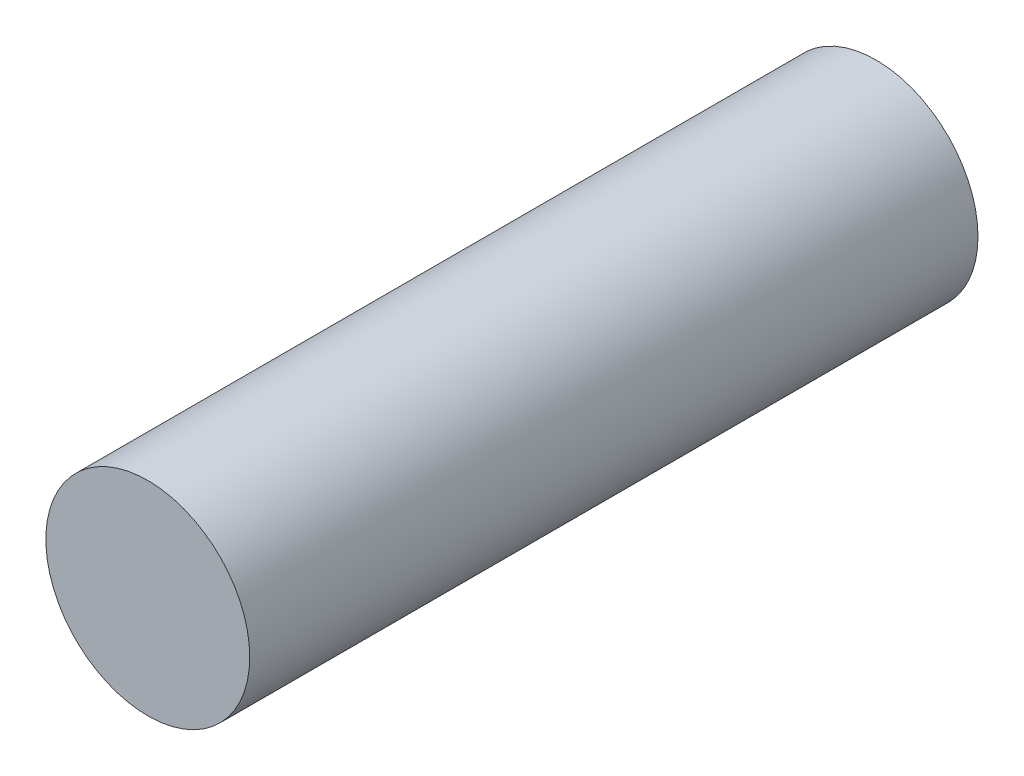
ISO-10303-21;
HEADER;
FILE_DESCRIPTION(('STEP AP214'),'2;1');
FILE_NAME('part.step','',(''),(''),'','','');
FILE_SCHEMA(('AUTOMOTIVE_DESIGN { 1 0 10303 214 1 1 1 1 }'));
ENDSEC;
DATA;
#1=APPLICATION_CONTEXT('core data for automotive mechanical design processes');
#2=APPLICATION_PROTOCOL_DEFINITION('international standard','automotive_design',2000,#1);
#3=PRODUCT_CONTEXT('',#1,'mechanical');
#4=PRODUCT('Part','Part','',(#3));
#5=PRODUCT_RELATED_PRODUCT_CATEGORY('part','',(#4));
#6=PRODUCT_DEFINITION_FORMATION('','',#4);
#7=PRODUCT_DEFINITION_CONTEXT('part definition',#1,'design');
#8=PRODUCT_DEFINITION('design','',#6,#7);
#9=PRODUCT_DEFINITION_SHAPE('','',#8);
#10=(LENGTH_UNIT() NAMED_UNIT(*) SI_UNIT(.MILLI.,.METRE.));
#11=(NAMED_UNIT(*) PLANE_ANGLE_UNIT() SI_UNIT($,.RADIAN.));
#12=(NAMED_UNIT(*) SI_UNIT($,.STERADIAN.) SOLID_ANGLE_UNIT());
#13=UNCERTAINTY_MEASURE_WITH_UNIT(LENGTH_MEASURE(1.E-05),#10,'distance_accuracy_value','');
#14=(GEOMETRIC_REPRESENTATION_CONTEXT(3) GLOBAL_UNCERTAINTY_ASSIGNED_CONTEXT((#13)) GLOBAL_UNIT_ASSIGNED_CONTEXT((#10,
#11,#12)) REPRESENTATION_CONTEXT('',''));
#15=CARTESIAN_POINT('',(0.,0.,0.));
#16=DIRECTION('',(0.,0.,1.));
#17=DIRECTION('',(1.,0.,0.));
#18=AXIS2_PLACEMENT_3D('',#15,#16,#17);
#19=CARTESIAN_POINT('',(0.,0.,10.));
#20=DIRECTION('',(0.,0.,-1.));
#21=DIRECTION('',(-1.,0.,0.));
#22=AXIS2_PLACEMENT_3D('',#19,#20,#21);
#23=CYLINDRICAL_SURFACE('',#22,1.4);
#24=CARTESIAN_POINT('',(0.,0.,10.));
#25=DIRECTION('',(0.,0.,1.));
#26=DIRECTION('',(1.,0.,0.));
#27=AXIS2_PLACEMENT_3D('',#24,#25,#26);
#28=CIRCLE('',#27,1.4);
#29=CARTESIAN_POINT('',(1.4,0.,10.));
#30=VERTEX_POINT('',#29);
#31=EDGE_CURVE('E10',#30,#30,#28,.T.);
#32=ORIENTED_EDGE('',*,*,#31,.F.);
#33=EDGE_LOOP('',(#32));
#34=FACE_BOUND('',#33,.T.);
#35=CARTESIAN_POINT('',(0.,0.,0.));
#36=DIRECTION('',(0.,0.,1.));
#37=DIRECTION('',(1.,0.,0.));
#38=AXIS2_PLACEMENT_3D('',#35,#36,#37);
#39=CIRCLE('',#38,1.4);
#40=CARTESIAN_POINT('',(1.4,0.,0.));
#41=VERTEX_POINT('',#40);
#42=EDGE_CURVE('E36',#41,#41,#39,.T.);
#43=ORIENTED_EDGE('',*,*,#42,.T.);
#44=EDGE_LOOP('',(#43));
#45=FACE_BOUND('',#44,.T.);
#46=ADVANCED_FACE('F33',(#34,#45),#23,.T.);
#47=CARTESIAN_POINT('',(0.,0.,10.));
#48=DIRECTION('',(0.,0.,1.));
#49=DIRECTION('',(1.,0.,0.));
#50=AXIS2_PLACEMENT_3D('',#47,#48,#49);
#51=PLANE('',#50);
#52=ORIENTED_EDGE('',*,*,#31,.T.);
#53=EDGE_LOOP('',(#52));
#54=FACE_BOUND('',#53,.T.);
#55=ADVANCED_FACE('F48',(#54),#51,.T.);
#56=CARTESIAN_POINT('',(0.,0.,0.));
#57=DIRECTION('',(0.,0.,1.));
#58=DIRECTION('',(1.,0.,0.));
#59=AXIS2_PLACEMENT_3D('',#56,#57,#58);
#60=PLANE('',#59);
#61=ORIENTED_EDGE('',*,*,#42,.F.);
#62=EDGE_LOOP('',(#61));
#63=FACE_BOUND('',#62,.T.);
#64=ADVANCED_FACE('F46',(#63),#60,.F.);
#65=CLOSED_SHELL('',(#46,#55,#64));
#66=MANIFOLD_SOLID_BREP('B2',#65);
#67=ADVANCED_BREP_SHAPE_REPRESENTATION('',(#18,#66),#14);
#68=SHAPE_DEFINITION_REPRESENTATION(#9,#67);
ENDSEC;
END-ISO-10303-21;
